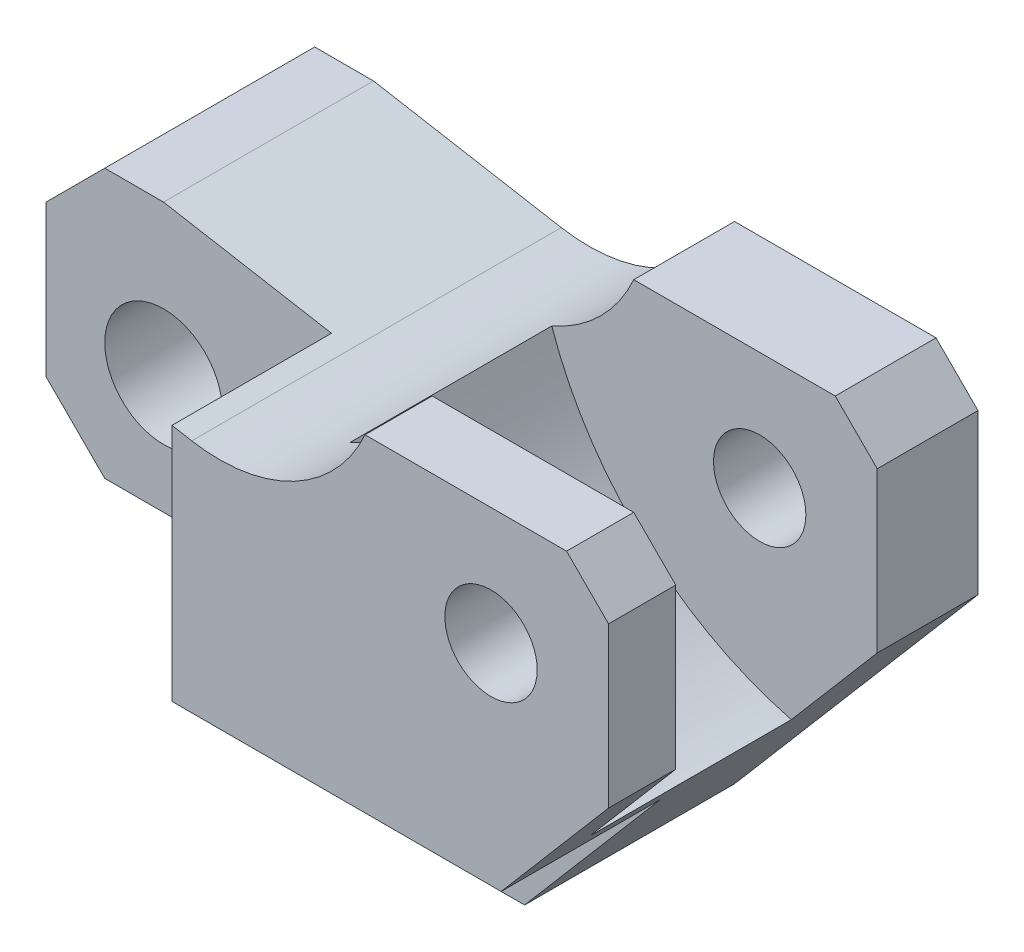
ISO-10303-21;
HEADER;
FILE_DESCRIPTION(('STEP AP214'),'2;1');
FILE_NAME('part.step','',(''),(''),'','','');
FILE_SCHEMA(('AUTOMOTIVE_DESIGN { 1 0 10303 214 1 1 1 1 }'));
ENDSEC;
DATA;
#1=APPLICATION_CONTEXT('core data for automotive mechanical design processes');
#2=APPLICATION_PROTOCOL_DEFINITION('international standard','automotive_design',2000,#1);
#3=PRODUCT_CONTEXT('',#1,'mechanical');
#4=PRODUCT('Part','Part','',(#3));
#5=PRODUCT_RELATED_PRODUCT_CATEGORY('part','',(#4));
#6=PRODUCT_DEFINITION_FORMATION('','',#4);
#7=PRODUCT_DEFINITION_CONTEXT('part definition',#1,'design');
#8=PRODUCT_DEFINITION('design','',#6,#7);
#9=PRODUCT_DEFINITION_SHAPE('','',#8);
#10=(LENGTH_UNIT() NAMED_UNIT(*) SI_UNIT(.MILLI.,.METRE.));
#11=(NAMED_UNIT(*) PLANE_ANGLE_UNIT() SI_UNIT($,.RADIAN.));
#12=(NAMED_UNIT(*) SI_UNIT($,.STERADIAN.) SOLID_ANGLE_UNIT());
#13=UNCERTAINTY_MEASURE_WITH_UNIT(LENGTH_MEASURE(1.E-05),#10,'distance_accuracy_value','');
#14=(GEOMETRIC_REPRESENTATION_CONTEXT(3) GLOBAL_UNCERTAINTY_ASSIGNED_CONTEXT((#13)) GLOBAL_UNIT_ASSIGNED_CONTEXT((#10,
#11,#12)) REPRESENTATION_CONTEXT('',''));
#15=CARTESIAN_POINT('',(0.,0.,0.));
#16=DIRECTION('',(0.,0.,1.));
#17=DIRECTION('',(1.,0.,0.));
#18=AXIS2_PLACEMENT_3D('',#15,#16,#17);
#19=CARTESIAN_POINT('',(72.,1.,44.));
#20=DIRECTION('',(-0.760833951959086,0.64894660608275,0.));
#21=DIRECTION('',(-0.64894660608275,-0.760833951959086,0.));
#22=AXIS2_PLACEMENT_3D('',#19,#20,#21);
#23=PLANE('',#22);
#24=DIRECTION('',(-0.64894660608275,-0.760833951959086,0.));
#25=VECTOR('',#24,1.);
#26=CARTESIAN_POINT('',(61.7647058823529,-11.,36.));
#27=LINE('',#26,#25);
#28=CARTESIAN_POINT('',(72.,1.,36.));
#29=VERTEX_POINT('',#28);
#30=CARTESIAN_POINT('',(61.7647058823529,-11.,36.));
#31=VERTEX_POINT('',#30);
#32=EDGE_CURVE('E423',#29,#31,#27,.T.);
#33=ORIENTED_EDGE('',*,*,#32,.F.);
#34=DIRECTION('',(0.,0.,-1.));
#35=VECTOR('',#34,1.);
#36=CARTESIAN_POINT('',(72.,1.,44.));
#37=LINE('',#36,#35);
#38=CARTESIAN_POINT('',(72.,1.,44.));
#39=VERTEX_POINT('',#38);
#40=EDGE_CURVE('E242',#39,#29,#37,.T.);
#41=ORIENTED_EDGE('',*,*,#40,.F.);
#42=DIRECTION('',(0.64894660608275,0.760833951959086,0.));
#43=VECTOR('',#42,1.);
#44=CARTESIAN_POINT('',(72.,1.,44.));
#45=LINE('',#44,#43);
#46=CARTESIAN_POINT('',(59.2058823529412,-14.,44.));
#47=VERTEX_POINT('',#46);
#48=EDGE_CURVE('E318',#47,#39,#45,.T.);
#49=ORIENTED_EDGE('',*,*,#48,.F.);
#50=DIRECTION('',(0.,0.,-1.));
#51=VECTOR('',#50,1.);
#52=CARTESIAN_POINT('',(59.2058823529412,-14.,184.845660210033));
#53=LINE('',#52,#51);
#54=CARTESIAN_POINT('',(59.2058823529412,-14.,25.));
#55=VERTEX_POINT('',#54);
#56=EDGE_CURVE('E302',#47,#55,#53,.T.);
#57=ORIENTED_EDGE('',*,*,#56,.T.);
#58=DIRECTION('',(0.64894660608275,0.760833951959086,0.));
#59=VECTOR('',#58,1.);
#60=CARTESIAN_POINT('',(72.,1.,25.));
#61=LINE('',#60,#59);
#62=CARTESIAN_POINT('',(43.,-33.,25.));
#63=VERTEX_POINT('',#62);
#64=EDGE_CURVE('E303',#63,#55,#61,.T.);
#65=ORIENTED_EDGE('',*,*,#64,.F.);
#66=DIRECTION('',(0.,0.,-1.));
#67=VECTOR('',#66,1.);
#68=CARTESIAN_POINT('',(43.,-33.,44.));
#69=LINE('',#68,#67);
#70=CARTESIAN_POINT('',(43.,-33.,0.));
#71=VERTEX_POINT('',#70);
#72=EDGE_CURVE('E245',#63,#71,#69,.T.);
#73=ORIENTED_EDGE('',*,*,#72,.T.);
#74=DIRECTION('',(0.64894660608275,0.760833951959086,0.));
#75=VECTOR('',#74,1.);
#76=CARTESIAN_POINT('',(72.,1.,0.));
#77=LINE('',#76,#75);
#78=CARTESIAN_POINT('',(72.,1.,0.));
#79=VERTEX_POINT('',#78);
#80=EDGE_CURVE('E349',#71,#79,#77,.T.);
#81=ORIENTED_EDGE('',*,*,#80,.T.);
#82=CARTESIAN_POINT('',(72.,1.,12.));
#83=VERTEX_POINT('',#82);
#84=EDGE_CURVE('E241',#83,#79,#37,.T.);
#85=ORIENTED_EDGE('',*,*,#84,.F.);
#86=DIRECTION('',(-0.64894660608275,-0.760833951959086,0.));
#87=VECTOR('',#86,1.);
#88=CARTESIAN_POINT('',(61.7647058823529,-11.,12.));
#89=LINE('',#88,#87);
#90=CARTESIAN_POINT('',(61.7647058823529,-11.,12.));
#91=VERTEX_POINT('',#90);
#92=EDGE_CURVE('E436',#83,#91,#89,.T.);
#93=ORIENTED_EDGE('',*,*,#92,.T.);
#94=DIRECTION('',(0.,0.,-1.));
#95=VECTOR('',#94,1.);
#96=CARTESIAN_POINT('',(61.7647058823529,-11.,36.));
#97=LINE('',#96,#95);
#98=EDGE_CURVE('E267',#31,#91,#97,.T.);
#99=ORIENTED_EDGE('',*,*,#98,.F.);
#100=EDGE_LOOP('',(#33,#41,#49,#57,#65,#73,#81,#85,#93,#99));
#101=FACE_BOUND('',#100,.T.);
#102=ADVANCED_FACE('F45',(#101),#23,.F.);
#103=CARTESIAN_POINT('',(72.,20.,44.));
#104=DIRECTION('',(-1.,0.,0.));
#105=DIRECTION('',(0.,0.,1.));
#106=AXIS2_PLACEMENT_3D('',#103,#104,#105);
#107=PLANE('',#106);
#108=DIRECTION('',(0.,-1.,0.));
#109=VECTOR('',#108,1.);
#110=CARTESIAN_POINT('',(72.,1.,36.));
#111=LINE('',#110,#109);
#112=CARTESIAN_POINT('',(72.,20.,36.));
#113=VERTEX_POINT('',#112);
#114=EDGE_CURVE('E421',#113,#29,#111,.T.);
#115=ORIENTED_EDGE('',*,*,#114,.F.);
#116=DIRECTION('',(0.,0.,-1.));
#117=VECTOR('',#116,1.);
#118=CARTESIAN_POINT('',(72.,20.,44.));
#119=LINE('',#118,#117);
#120=CARTESIAN_POINT('',(72.,20.,44.));
#121=VERTEX_POINT('',#120);
#122=EDGE_CURVE('E238',#121,#113,#119,.T.);
#123=ORIENTED_EDGE('',*,*,#122,.F.);
#124=DIRECTION('',(0.,1.,0.));
#125=VECTOR('',#124,1.);
#126=CARTESIAN_POINT('',(72.,20.,44.));
#127=LINE('',#126,#125);
#128=EDGE_CURVE('E321',#39,#121,#127,.T.);
#129=ORIENTED_EDGE('',*,*,#128,.F.);
#130=ORIENTED_EDGE('',*,*,#40,.T.);
#131=EDGE_LOOP('',(#115,#123,#129,#130));
#132=FACE_BOUND('',#131,.T.);
#133=ADVANCED_FACE('F480',(#132),#107,.F.);
#134=CARTESIAN_POINT('',(66.9999999999999,25.,44.));
#135=DIRECTION('',(-0.707106781186543,-0.707106781186552,0.));
#136=DIRECTION('',(0.707106781186552,-0.707106781186543,0.));
#137=AXIS2_PLACEMENT_3D('',#134,#135,#136);
#138=PLANE('',#137);
#139=DIRECTION('',(0.707106781186552,-0.707106781186543,0.));
#140=VECTOR('',#139,1.);
#141=CARTESIAN_POINT('',(72.,20.,36.));
#142=LINE('',#141,#140);
#143=CARTESIAN_POINT('',(66.9999999999999,25.,36.));
#144=VERTEX_POINT('',#143);
#145=EDGE_CURVE('E224',#144,#113,#142,.T.);
#146=ORIENTED_EDGE('',*,*,#145,.F.);
#147=DIRECTION('',(0.,0.,-1.));
#148=VECTOR('',#147,1.);
#149=CARTESIAN_POINT('',(66.9999999999999,25.,44.));
#150=LINE('',#149,#148);
#151=CARTESIAN_POINT('',(66.9999999999999,25.,44.));
#152=VERTEX_POINT('',#151);
#153=EDGE_CURVE('E223',#152,#144,#150,.T.);
#154=ORIENTED_EDGE('',*,*,#153,.F.);
#155=DIRECTION('',(-0.707106781186552,0.707106781186543,0.));
#156=VECTOR('',#155,1.);
#157=CARTESIAN_POINT('',(66.9999999999999,25.,44.));
#158=LINE('',#157,#156);
#159=EDGE_CURVE('E323',#121,#152,#158,.T.);
#160=ORIENTED_EDGE('',*,*,#159,.F.);
#161=ORIENTED_EDGE('',*,*,#122,.T.);
#162=EDGE_LOOP('',(#146,#154,#160,#161));
#163=FACE_BOUND('',#162,.T.);
#164=ADVANCED_FACE('F419',(#163),#138,.F.);
#165=CARTESIAN_POINT('',(43.,25.,44.));
#166=DIRECTION('',(0.,-1.,0.));
#167=DIRECTION('',(0.,0.,-1.));
#168=AXIS2_PLACEMENT_3D('',#165,#166,#167);
#169=PLANE('',#168);
#170=DIRECTION('',(1.,0.,0.));
#171=VECTOR('',#170,1.);
#172=CARTESIAN_POINT('',(66.9999999999999,25.,36.));
#173=LINE('',#172,#171);
#174=CARTESIAN_POINT('',(43.,25.,36.));
#175=VERTEX_POINT('',#174);
#176=EDGE_CURVE('E206',#175,#144,#173,.T.);
#177=ORIENTED_EDGE('',*,*,#176,.F.);
#178=DIRECTION('',(0.,0.,-1.));
#179=VECTOR('',#178,1.);
#180=CARTESIAN_POINT('',(43.,25.,44.));
#181=LINE('',#180,#179);
#182=CARTESIAN_POINT('',(43.,25.,44.));
#183=VERTEX_POINT('',#182);
#184=EDGE_CURVE('E220',#183,#175,#181,.T.);
#185=ORIENTED_EDGE('',*,*,#184,.F.);
#186=DIRECTION('',(-1.,0.,0.));
#187=VECTOR('',#186,1.);
#188=CARTESIAN_POINT('',(43.,25.,44.));
#189=LINE('',#188,#187);
#190=EDGE_CURVE('E325',#152,#183,#189,.T.);
#191=ORIENTED_EDGE('',*,*,#190,.F.);
#192=ORIENTED_EDGE('',*,*,#153,.T.);
#193=EDGE_LOOP('',(#177,#185,#191,#192));
#194=FACE_BOUND('',#193,.T.);
#195=ADVANCED_FACE('F218',(#194),#169,.F.);
#196=CARTESIAN_POINT('',(25.6606962114488,32.7684325399872,44.));
#197=DIRECTION('',(0.,0.,-1.));
#198=DIRECTION('',(-1.,0.,0.));
#199=AXIS2_PLACEMENT_3D('',#196,#197,#198);
#200=CYLINDRICAL_SURFACE('',#199,19.);
#201=CARTESIAN_POINT('',(25.6606962114488,32.7684325399872,36.));
#202=DIRECTION('',(0.,0.,1.));
#203=DIRECTION('',(-1.,0.,0.));
#204=AXIS2_PLACEMENT_3D('',#201,#202,#203);
#205=CIRCLE('',#204,19.);
#206=CARTESIAN_POINT('',(33.2369365490243,15.344294617344,36.));
#207=VERTEX_POINT('',#206);
#208=EDGE_CURVE('E202',#207,#175,#205,.T.);
#209=ORIENTED_EDGE('',*,*,#208,.F.);
#210=DIRECTION('',(0.,0.,-1.));
#211=VECTOR('',#210,1.);
#212=CARTESIAN_POINT('',(33.2369365490243,15.344294617344,36.));
#213=LINE('',#212,#211);
#214=CARTESIAN_POINT('',(33.2369365490243,15.344294617344,12.));
#215=VERTEX_POINT('',#214);
#216=EDGE_CURVE('E262',#207,#215,#213,.T.);
#217=ORIENTED_EDGE('',*,*,#216,.T.);
#218=CARTESIAN_POINT('',(25.6606962114488,32.7684325399872,12.));
#219=DIRECTION('',(0.,0.,1.));
#220=DIRECTION('',(-1.,0.,0.));
#221=AXIS2_PLACEMENT_3D('',#218,#219,#220);
#222=CIRCLE('',#221,19.);
#223=CARTESIAN_POINT('',(43.,25.,12.));
#224=VERTEX_POINT('',#223);
#225=EDGE_CURVE('E428',#215,#224,#222,.T.);
#226=ORIENTED_EDGE('',*,*,#225,.T.);
#227=CARTESIAN_POINT('',(43.,25.,0.));
#228=VERTEX_POINT('',#227);
#229=EDGE_CURVE('E230',#224,#228,#181,.T.);
#230=ORIENTED_EDGE('',*,*,#229,.T.);
#231=CARTESIAN_POINT('',(25.6606962114488,32.7684325399872,0.));
#232=DIRECTION('',(0.,0.,-1.));
#233=DIRECTION('',(1.,0.,0.));
#234=AXIS2_PLACEMENT_3D('',#231,#232,#233);
#235=CIRCLE('',#234,19.);
#236=CARTESIAN_POINT('',(22.3613808357771,14.0570852327553,0.));
#237=VERTEX_POINT('',#236);
#238=EDGE_CURVE('E361',#228,#237,#235,.T.);
#239=ORIENTED_EDGE('',*,*,#238,.T.);
#240=DIRECTION('',(0.,0.,-1.));
#241=VECTOR('',#240,1.);
#242=CARTESIAN_POINT('',(22.3613808357771,14.0570852327553,44.));
#243=LINE('',#242,#241);
#244=CARTESIAN_POINT('',(22.3613808357771,14.0570852327553,44.));
#245=VERTEX_POINT('',#244);
#246=EDGE_CURVE('E233',#245,#237,#243,.T.);
#247=ORIENTED_EDGE('',*,*,#246,.F.);
#248=CARTESIAN_POINT('',(25.6606962114488,32.7684325399872,44.));
#249=DIRECTION('',(0.,0.,-1.));
#250=DIRECTION('',(1.,0.,0.));
#251=AXIS2_PLACEMENT_3D('',#248,#249,#250);
#252=CIRCLE('',#251,19.);
#253=EDGE_CURVE('E228',#183,#245,#252,.T.);
#254=ORIENTED_EDGE('',*,*,#253,.F.);
#255=ORIENTED_EDGE('',*,*,#184,.T.);
#256=EDGE_LOOP('',(#209,#217,#226,#230,#239,#247,#254,#255));
#257=FACE_BOUND('',#256,.T.);
#258=ADVANCED_FACE('F226',(#257),#200,.F.);
#259=CARTESIAN_POINT('',(58.,11.,0.));
#260=DIRECTION('',(0.,0.,1.));
#261=DIRECTION('',(1.,0.,0.));
#262=AXIS2_PLACEMENT_3D('',#259,#260,#261);
#263=CYLINDRICAL_SURFACE('',#262,5.5);
#264=CARTESIAN_POINT('',(58.,11.,44.));
#265=DIRECTION('',(0.,0.,1.));
#266=DIRECTION('',(1.,0.,0.));
#267=AXIS2_PLACEMENT_3D('',#264,#265,#266);
#268=CIRCLE('',#267,5.5);
#269=CARTESIAN_POINT('',(63.5,11.,44.));
#270=VERTEX_POINT('',#269);
#271=EDGE_CURVE('E266',#270,#270,#268,.T.);
#272=ORIENTED_EDGE('',*,*,#271,.T.);
#273=EDGE_LOOP('',(#272));
#274=FACE_BOUND('',#273,.T.);
#275=CARTESIAN_POINT('',(58.,11.,36.));
#276=DIRECTION('',(0.,0.,-1.));
#277=DIRECTION('',(-1.,0.,0.));
#278=AXIS2_PLACEMENT_3D('',#275,#276,#277);
#279=CIRCLE('',#278,5.5);
#280=CARTESIAN_POINT('',(52.5,11.,36.));
#281=VERTEX_POINT('',#280);
#282=EDGE_CURVE('E49',#281,#281,#279,.F.);
#283=ORIENTED_EDGE('',*,*,#282,.F.);
#284=EDGE_LOOP('',(#283));
#285=FACE_BOUND('',#284,.T.);
#286=ADVANCED_FACE('F515',(#274,#285),#263,.F.);
#287=CARTESIAN_POINT('',(25.5755389113407,-19.,44.));
#288=DIRECTION('',(0.,0.,-1.));
#289=DIRECTION('',(-1.,0.,0.));
#290=AXIS2_PLACEMENT_3D('',#287,#288,#289);
#291=PLANE('',#290);
#292=ORIENTED_EDGE('',*,*,#271,.F.);
#293=EDGE_LOOP('',(#292));
#294=FACE_BOUND('',#293,.T.);
#295=DIRECTION('',(-0.984807753012208,0.173648177666931,0.));
#296=VECTOR('',#295,1.);
#297=CARTESIAN_POINT('',(0.,18.,44.));
#298=LINE('',#297,#296);
#299=CARTESIAN_POINT('',(20.,14.4734603858307,44.));
#300=VERTEX_POINT('',#299);
#301=EDGE_CURVE('E328',#245,#300,#298,.T.);
#302=ORIENTED_EDGE('',*,*,#301,.T.);
#303=DIRECTION('',(0.,1.,0.));
#304=VECTOR('',#303,1.);
#305=CARTESIAN_POINT('',(20.,-33.,44.));
#306=LINE('',#305,#304);
#307=CARTESIAN_POINT('',(20.,-14.,44.));
#308=VERTEX_POINT('',#307);
#309=EDGE_CURVE('E279',#308,#300,#306,.T.);
#310=ORIENTED_EDGE('',*,*,#309,.F.);
#311=DIRECTION('',(1.,0.,0.));
#312=VECTOR('',#311,1.);
#313=CARTESIAN_POINT('',(-6.99999999999997,-14.,44.));
#314=LINE('',#313,#312);
#315=EDGE_CURVE('E316',#308,#47,#314,.T.);
#316=ORIENTED_EDGE('',*,*,#315,.T.);
#317=ORIENTED_EDGE('',*,*,#48,.T.);
#318=ORIENTED_EDGE('',*,*,#128,.T.);
#319=ORIENTED_EDGE('',*,*,#159,.T.);
#320=ORIENTED_EDGE('',*,*,#190,.T.);
#321=ORIENTED_EDGE('',*,*,#253,.T.);
#322=EDGE_LOOP('',(#302,#310,#316,#317,#318,#319,#320,#321));
#323=FACE_BOUND('',#322,.T.);
#324=ADVANCED_FACE('F414',(#294,#323),#291,.F.);
#325=CARTESIAN_POINT('',(25.5755389113407,-19.,0.));
#326=DIRECTION('',(0.,0.,-1.));
#327=DIRECTION('',(-1.,0.,0.));
#328=AXIS2_PLACEMENT_3D('',#325,#326,#327);
#329=PLANE('',#328);
#330=CARTESIAN_POINT('',(58.,11.,0.));
#331=DIRECTION('',(0.,0.,1.));
#332=DIRECTION('',(1.,0.,0.));
#333=AXIS2_PLACEMENT_3D('',#330,#331,#332);
#334=CIRCLE('',#333,5.5);
#335=CARTESIAN_POINT('',(63.5,11.,0.));
#336=VERTEX_POINT('',#335);
#337=EDGE_CURVE('E273',#336,#336,#334,.T.);
#338=ORIENTED_EDGE('',*,*,#337,.T.);
#339=EDGE_LOOP('',(#338));
#340=FACE_BOUND('',#339,.T.);
#341=DIRECTION('',(0.,-1.,0.));
#342=VECTOR('',#341,1.);
#343=CARTESIAN_POINT('',(-14.,11.,0.));
#344=LINE('',#343,#342);
#345=CARTESIAN_POINT('',(-14.,11.,0.));
#346=VERTEX_POINT('',#345);
#347=CARTESIAN_POINT('',(-14.,-7.,0.));
#348=VERTEX_POINT('',#347);
#349=EDGE_CURVE('E315',#346,#348,#344,.T.);
#350=ORIENTED_EDGE('',*,*,#349,.F.);
#351=DIRECTION('',(-0.707106781186543,-0.707106781186552,0.));
#352=VECTOR('',#351,1.);
#353=CARTESIAN_POINT('',(-14.,11.,0.));
#354=LINE('',#353,#352);
#355=CARTESIAN_POINT('',(-7.0000000000001,18.,0.));
#356=VERTEX_POINT('',#355);
#357=EDGE_CURVE('E319',#356,#346,#354,.T.);
#358=ORIENTED_EDGE('',*,*,#357,.F.);
#359=DIRECTION('',(-1.,0.,0.));
#360=VECTOR('',#359,1.);
#361=CARTESIAN_POINT('',(-7.0000000000001,18.,0.));
#362=LINE('',#361,#360);
#363=CARTESIAN_POINT('',(0.,18.,0.));
#364=VERTEX_POINT('',#363);
#365=EDGE_CURVE('E366',#364,#356,#362,.T.);
#366=ORIENTED_EDGE('',*,*,#365,.F.);
#367=DIRECTION('',(-0.984807753012208,0.173648177666931,0.));
#368=VECTOR('',#367,1.);
#369=CARTESIAN_POINT('',(0.,18.,0.));
#370=LINE('',#369,#368);
#371=EDGE_CURVE('E363',#237,#364,#370,.T.);
#372=ORIENTED_EDGE('',*,*,#371,.F.);
#373=ORIENTED_EDGE('',*,*,#238,.F.);
#374=DIRECTION('',(-1.,0.,0.));
#375=VECTOR('',#374,1.);
#376=CARTESIAN_POINT('',(43.,25.,0.));
#377=LINE('',#376,#375);
#378=CARTESIAN_POINT('',(66.9999999999999,25.,0.));
#379=VERTEX_POINT('',#378);
#380=EDGE_CURVE('E358',#379,#228,#377,.T.);
#381=ORIENTED_EDGE('',*,*,#380,.F.);
#382=DIRECTION('',(-0.707106781186552,0.707106781186543,0.));
#383=VECTOR('',#382,1.);
#384=CARTESIAN_POINT('',(66.9999999999999,25.,0.));
#385=LINE('',#384,#383);
#386=CARTESIAN_POINT('',(72.,20.,0.));
#387=VERTEX_POINT('',#386);
#388=EDGE_CURVE('E355',#387,#379,#385,.T.);
#389=ORIENTED_EDGE('',*,*,#388,.F.);
#390=DIRECTION('',(0.,1.,0.));
#391=VECTOR('',#390,1.);
#392=CARTESIAN_POINT('',(72.,20.,0.));
#393=LINE('',#392,#391);
#394=EDGE_CURVE('E352',#79,#387,#393,.T.);
#395=ORIENTED_EDGE('',*,*,#394,.F.);
#396=ORIENTED_EDGE('',*,*,#80,.F.);
#397=DIRECTION('',(1.,0.,0.));
#398=VECTOR('',#397,1.);
#399=CARTESIAN_POINT('',(43.,-33.,0.));
#400=LINE('',#399,#398);
#401=CARTESIAN_POINT('',(37.2969800527345,-33.,0.));
#402=VERTEX_POINT('',#401);
#403=EDGE_CURVE('E346',#402,#71,#400,.T.);
#404=ORIENTED_EDGE('',*,*,#403,.F.);
#405=CARTESIAN_POINT('',(59.2058823529412,-14.,0.));
#406=DIRECTION('',(0.,0.,1.));
#407=DIRECTION('',(1.,0.,0.));
#408=AXIS2_PLACEMENT_3D('',#405,#406,#407);
#409=CIRCLE('',#408,29.);
#410=CARTESIAN_POINT('',(30.5211776527525,-18.2647058823529,0.));
#411=VERTEX_POINT('',#410);
#412=EDGE_CURVE('E343',#411,#402,#409,.T.);
#413=ORIENTED_EDGE('',*,*,#412,.F.);
#414=CARTESIAN_POINT('',(25.5755389113407,-19.,0.));
#415=DIRECTION('',(0.,0.,-1.));
#416=DIRECTION('',(-1.,0.,0.));
#417=AXIS2_PLACEMENT_3D('',#414,#415,#416);
#418=CIRCLE('',#417,5.);
#419=CARTESIAN_POINT('',(25.5755389113407,-14.,0.));
#420=VERTEX_POINT('',#419);
#421=EDGE_CURVE('E340',#420,#411,#418,.T.);
#422=ORIENTED_EDGE('',*,*,#421,.F.);
#423=DIRECTION('',(1.,0.,0.));
#424=VECTOR('',#423,1.);
#425=CARTESIAN_POINT('',(-6.99999999999997,-14.,0.));
#426=LINE('',#425,#424);
#427=CARTESIAN_POINT('',(-6.99999999999997,-14.,0.));
#428=VERTEX_POINT('',#427);
#429=EDGE_CURVE('E337',#428,#420,#426,.T.);
#430=ORIENTED_EDGE('',*,*,#429,.F.);
#431=DIRECTION('',(0.707106781186549,-0.707106781186546,0.));
#432=VECTOR('',#431,1.);
#433=CARTESIAN_POINT('',(-14.,-7.,0.));
#434=LINE('',#433,#432);
#435=EDGE_CURVE('E334',#348,#428,#434,.T.);
#436=ORIENTED_EDGE('',*,*,#435,.F.);
#437=EDGE_LOOP('',(#350,#358,#366,#372,#373,#381,#389,#395,#396,#404,#413,#422,#430,#436));
#438=FACE_BOUND('',#437,.T.);
#439=CARTESIAN_POINT('',(0.,0.,0.));
#440=DIRECTION('',(0.,0.,1.));
#441=DIRECTION('',(1.,0.,0.));
#442=AXIS2_PLACEMENT_3D('',#439,#440,#441);
#443=CIRCLE('',#442,7.);
#444=CARTESIAN_POINT('',(7.,0.,0.));
#445=VERTEX_POINT('',#444);
#446=EDGE_CURVE('E306',#445,#445,#443,.T.);
#447=ORIENTED_EDGE('',*,*,#446,.T.);
#448=EDGE_LOOP('',(#447));
#449=FACE_BOUND('',#448,.T.);
#450=ADVANCED_FACE('F385',(#340,#438,#449),#329,.T.);
#451=CARTESIAN_POINT('',(-14.,11.,44.));
#452=DIRECTION('',(1.,0.,0.));
#453=DIRECTION('',(0.,0.,-1.));
#454=AXIS2_PLACEMENT_3D('',#451,#452,#453);
#455=PLANE('',#454);
#456=DIRECTION('',(0.,0.,-1.));
#457=VECTOR('',#456,1.);
#458=CARTESIAN_POINT('',(-14.,-7.,44.));
#459=LINE('',#458,#457);
#460=CARTESIAN_POINT('',(-14.,-7.,25.));
#461=VERTEX_POINT('',#460);
#462=EDGE_CURVE('E54',#461,#348,#459,.T.);
#463=ORIENTED_EDGE('',*,*,#462,.F.);
#464=DIRECTION('',(0.,1.,0.));
#465=VECTOR('',#464,1.);
#466=CARTESIAN_POINT('',(-14.,11.,25.));
#467=LINE('',#466,#465);
#468=CARTESIAN_POINT('',(-14.,11.,25.));
#469=VERTEX_POINT('',#468);
#470=EDGE_CURVE('E284',#461,#469,#467,.T.);
#471=ORIENTED_EDGE('',*,*,#470,.T.);
#472=DIRECTION('',(0.,0.,-1.));
#473=VECTOR('',#472,1.);
#474=CARTESIAN_POINT('',(-14.,11.,44.));
#475=LINE('',#474,#473);
#476=EDGE_CURVE('E331',#469,#346,#475,.T.);
#477=ORIENTED_EDGE('',*,*,#476,.T.);
#478=ORIENTED_EDGE('',*,*,#349,.T.);
#479=EDGE_LOOP('',(#463,#471,#477,#478));
#480=FACE_BOUND('',#479,.T.);
#481=ADVANCED_FACE('F47',(#480),#455,.F.);
#482=CARTESIAN_POINT('',(-14.,-7.,44.));
#483=DIRECTION('',(0.707106781186546,0.707106781186549,0.));
#484=DIRECTION('',(-0.707106781186549,0.707106781186546,0.));
#485=AXIS2_PLACEMENT_3D('',#482,#483,#484);
#486=PLANE('',#485);
#487=DIRECTION('',(0.,0.,-1.));
#488=VECTOR('',#487,1.);
#489=CARTESIAN_POINT('',(-6.99999999999997,-14.,44.));
#490=LINE('',#489,#488);
#491=CARTESIAN_POINT('',(-6.99999999999997,-14.,25.));
#492=VERTEX_POINT('',#491);
#493=EDGE_CURVE('E253',#492,#428,#490,.T.);
#494=ORIENTED_EDGE('',*,*,#493,.F.);
#495=DIRECTION('',(-0.707106781186549,0.707106781186546,0.));
#496=VECTOR('',#495,1.);
#497=CARTESIAN_POINT('',(-14.,-7.,25.));
#498=LINE('',#497,#496);
#499=EDGE_CURVE('E287',#492,#461,#498,.T.);
#500=ORIENTED_EDGE('',*,*,#499,.T.);
#501=ORIENTED_EDGE('',*,*,#462,.T.);
#502=ORIENTED_EDGE('',*,*,#435,.T.);
#503=EDGE_LOOP('',(#494,#500,#501,#502));
#504=FACE_BOUND('',#503,.T.);
#505=ADVANCED_FACE('F400',(#504),#486,.F.);
#506=CARTESIAN_POINT('',(-6.99999999999997,-14.,44.));
#507=DIRECTION('',(0.,1.,0.));
#508=DIRECTION('',(0.,0.,1.));
#509=AXIS2_PLACEMENT_3D('',#506,#507,#508);
#510=PLANE('',#509);
#511=DIRECTION('',(0.,0.,-1.));
#512=VECTOR('',#511,1.);
#513=CARTESIAN_POINT('',(20.,-14.,44.));
#514=LINE('',#513,#512);
#515=CARTESIAN_POINT('',(20.,-14.,25.));
#516=VERTEX_POINT('',#515);
#517=EDGE_CURVE('E296',#308,#516,#514,.T.);
#518=ORIENTED_EDGE('',*,*,#517,.T.);
#519=DIRECTION('',(-1.,0.,0.));
#520=VECTOR('',#519,1.);
#521=CARTESIAN_POINT('',(-6.99999999999997,-14.,25.));
#522=LINE('',#521,#520);
#523=EDGE_CURVE('E290',#516,#492,#522,.T.);
#524=ORIENTED_EDGE('',*,*,#523,.T.);
#525=ORIENTED_EDGE('',*,*,#493,.T.);
#526=ORIENTED_EDGE('',*,*,#429,.T.);
#527=DIRECTION('',(0.,0.,-1.));
#528=VECTOR('',#527,1.);
#529=CARTESIAN_POINT('',(25.5755389113407,-14.,44.));
#530=LINE('',#529,#528);
#531=CARTESIAN_POINT('',(25.5755389113407,-14.,25.));
#532=VERTEX_POINT('',#531);
#533=EDGE_CURVE('E251',#532,#420,#530,.T.);
#534=ORIENTED_EDGE('',*,*,#533,.F.);
#535=DIRECTION('',(-1.,0.,0.));
#536=VECTOR('',#535,1.);
#537=CARTESIAN_POINT('',(25.5755389113407,-14.,25.));
#538=LINE('',#537,#536);
#539=EDGE_CURVE('E300',#55,#532,#538,.T.);
#540=ORIENTED_EDGE('',*,*,#539,.F.);
#541=ORIENTED_EDGE('',*,*,#56,.F.);
#542=ORIENTED_EDGE('',*,*,#315,.F.);
#543=EDGE_LOOP('',(#518,#524,#525,#526,#534,#540,#541,#542));
#544=FACE_BOUND('',#543,.T.);
#545=ADVANCED_FACE('F406',(#544),#510,.F.);
#546=CARTESIAN_POINT('',(25.5755389113407,-19.,44.));
#547=DIRECTION('',(0.,0.,-1.));
#548=DIRECTION('',(-1.,0.,0.));
#549=AXIS2_PLACEMENT_3D('',#546,#547,#548);
#550=CYLINDRICAL_SURFACE('',#549,5.);
#551=DIRECTION('',(0.,0.,-1.));
#552=VECTOR('',#551,1.);
#553=CARTESIAN_POINT('',(30.5211776527525,-18.2647058823529,44.));
#554=LINE('',#553,#552);
#555=CARTESIAN_POINT('',(30.5211776527525,-18.2647058823529,25.));
#556=VERTEX_POINT('',#555);
#557=EDGE_CURVE('E249',#556,#411,#554,.T.);
#558=ORIENTED_EDGE('',*,*,#557,.F.);
#559=CARTESIAN_POINT('',(25.5755389113407,-19.,25.));
#560=DIRECTION('',(0.,0.,-1.));
#561=DIRECTION('',(-1.,0.,0.));
#562=AXIS2_PLACEMENT_3D('',#559,#560,#561);
#563=CIRCLE('',#562,5.);
#564=EDGE_CURVE('E299',#532,#556,#563,.T.);
#565=ORIENTED_EDGE('',*,*,#564,.F.);
#566=ORIENTED_EDGE('',*,*,#533,.T.);
#567=ORIENTED_EDGE('',*,*,#421,.T.);
#568=EDGE_LOOP('',(#558,#565,#566,#567));
#569=FACE_BOUND('',#568,.T.);
#570=ADVANCED_FACE('F473',(#569),#550,.F.);
#571=CARTESIAN_POINT('',(59.2058823529412,-14.,44.));
#572=DIRECTION('',(0.,0.,-1.));
#573=DIRECTION('',(-1.,0.,0.));
#574=AXIS2_PLACEMENT_3D('',#571,#572,#573);
#575=CYLINDRICAL_SURFACE('',#574,29.);
#576=DIRECTION('',(0.,0.,-1.));
#577=VECTOR('',#576,1.);
#578=CARTESIAN_POINT('',(37.2969800527345,-33.,44.));
#579=LINE('',#578,#577);
#580=CARTESIAN_POINT('',(37.2969800527345,-33.,25.));
#581=VERTEX_POINT('',#580);
#582=EDGE_CURVE('E247',#581,#402,#579,.T.);
#583=ORIENTED_EDGE('',*,*,#582,.F.);
#584=CARTESIAN_POINT('',(59.2058823529412,-14.,25.));
#585=DIRECTION('',(0.,0.,1.));
#586=DIRECTION('',(1.,0.,0.));
#587=AXIS2_PLACEMENT_3D('',#584,#585,#586);
#588=CIRCLE('',#587,29.);
#589=EDGE_CURVE('E308',#556,#581,#588,.T.);
#590=ORIENTED_EDGE('',*,*,#589,.F.);
#591=ORIENTED_EDGE('',*,*,#557,.T.);
#592=ORIENTED_EDGE('',*,*,#412,.T.);
#593=EDGE_LOOP('',(#583,#590,#591,#592));
#594=FACE_BOUND('',#593,.T.);
#595=ADVANCED_FACE('F469',(#594),#575,.T.);
#596=CARTESIAN_POINT('',(43.,-33.,44.));
#597=DIRECTION('',(0.,1.,0.));
#598=DIRECTION('',(0.,0.,1.));
#599=AXIS2_PLACEMENT_3D('',#596,#597,#598);
#600=PLANE('',#599);
#601=ORIENTED_EDGE('',*,*,#72,.F.);
#602=DIRECTION('',(1.,0.,0.));
#603=VECTOR('',#602,1.);
#604=CARTESIAN_POINT('',(43.,-33.,25.));
#605=LINE('',#604,#603);
#606=EDGE_CURVE('E310',#581,#63,#605,.T.);
#607=ORIENTED_EDGE('',*,*,#606,.F.);
#608=ORIENTED_EDGE('',*,*,#582,.T.);
#609=ORIENTED_EDGE('',*,*,#403,.T.);
#610=EDGE_LOOP('',(#601,#607,#608,#609));
#611=FACE_BOUND('',#610,.T.);
#612=ADVANCED_FACE('F464',(#611),#600,.F.);
#613=CARTESIAN_POINT('',(72.,20.,12.));
#614=VERTEX_POINT('',#613);
#615=EDGE_CURVE('E237',#614,#387,#119,.T.);
#616=ORIENTED_EDGE('',*,*,#615,.F.);
#617=DIRECTION('',(0.,-1.,0.));
#618=VECTOR('',#617,1.);
#619=CARTESIAN_POINT('',(72.,1.,12.));
#620=LINE('',#619,#618);
#621=EDGE_CURVE('E434',#614,#83,#620,.T.);
#622=ORIENTED_EDGE('',*,*,#621,.T.);
#623=ORIENTED_EDGE('',*,*,#84,.T.);
#624=ORIENTED_EDGE('',*,*,#394,.T.);
#625=EDGE_LOOP('',(#616,#622,#623,#624));
#626=FACE_BOUND('',#625,.T.);
#627=ADVANCED_FACE('F458',(#626),#107,.F.);
#628=CARTESIAN_POINT('',(66.9999999999999,25.,12.));
#629=VERTEX_POINT('',#628);
#630=EDGE_CURVE('E229',#629,#379,#150,.T.);
#631=ORIENTED_EDGE('',*,*,#630,.F.);
#632=DIRECTION('',(0.707106781186552,-0.707106781186543,0.));
#633=VECTOR('',#632,1.);
#634=CARTESIAN_POINT('',(72.,20.,12.));
#635=LINE('',#634,#633);
#636=EDGE_CURVE('E431',#629,#614,#635,.T.);
#637=ORIENTED_EDGE('',*,*,#636,.T.);
#638=ORIENTED_EDGE('',*,*,#615,.T.);
#639=ORIENTED_EDGE('',*,*,#388,.T.);
#640=EDGE_LOOP('',(#631,#637,#638,#639));
#641=FACE_BOUND('',#640,.T.);
#642=ADVANCED_FACE('F455',(#641),#138,.F.);
#643=ORIENTED_EDGE('',*,*,#229,.F.);
#644=DIRECTION('',(1.,0.,0.));
#645=VECTOR('',#644,1.);
#646=CARTESIAN_POINT('',(66.9999999999999,25.,12.));
#647=LINE('',#646,#645);
#648=EDGE_CURVE('E62',#224,#629,#647,.T.);
#649=ORIENTED_EDGE('',*,*,#648,.T.);
#650=ORIENTED_EDGE('',*,*,#630,.T.);
#651=ORIENTED_EDGE('',*,*,#380,.T.);
#652=EDGE_LOOP('',(#643,#649,#650,#651));
#653=FACE_BOUND('',#652,.T.);
#654=ADVANCED_FACE('F449',(#653),#169,.F.);
#655=CARTESIAN_POINT('',(0.,18.,44.));
#656=DIRECTION('',(-0.173648177666931,-0.984807753012208,0.));
#657=DIRECTION('',(0.984807753012208,-0.173648177666931,0.));
#658=AXIS2_PLACEMENT_3D('',#655,#656,#657);
#659=PLANE('',#658);
#660=DIRECTION('',(0.,0.,-1.));
#661=VECTOR('',#660,1.);
#662=CARTESIAN_POINT('',(0.,18.,44.));
#663=LINE('',#662,#661);
#664=CARTESIAN_POINT('',(0.,18.,25.));
#665=VERTEX_POINT('',#664);
#666=EDGE_CURVE('E373',#665,#364,#663,.T.);
#667=ORIENTED_EDGE('',*,*,#666,.F.);
#668=DIRECTION('',(0.984807753012208,-0.173648177666931,0.));
#669=VECTOR('',#668,1.);
#670=CARTESIAN_POINT('',(0.,18.,25.));
#671=LINE('',#670,#669);
#672=CARTESIAN_POINT('',(20.,14.4734603858307,25.));
#673=VERTEX_POINT('',#672);
#674=EDGE_CURVE('E293',#665,#673,#671,.T.);
#675=ORIENTED_EDGE('',*,*,#674,.T.);
#676=DIRECTION('',(0.,0.,1.));
#677=VECTOR('',#676,1.);
#678=CARTESIAN_POINT('',(20.,14.4734603858307,44.));
#679=LINE('',#678,#677);
#680=EDGE_CURVE('E11',#673,#300,#679,.T.);
#681=ORIENTED_EDGE('',*,*,#680,.T.);
#682=ORIENTED_EDGE('',*,*,#301,.F.);
#683=ORIENTED_EDGE('',*,*,#246,.T.);
#684=ORIENTED_EDGE('',*,*,#371,.T.);
#685=EDGE_LOOP('',(#667,#675,#681,#682,#683,#684));
#686=FACE_BOUND('',#685,.T.);
#687=ADVANCED_FACE('F380',(#686),#659,.F.);
#688=CARTESIAN_POINT('',(-7.0000000000001,18.,44.));
#689=DIRECTION('',(0.,-1.,0.));
#690=DIRECTION('',(0.,0.,-1.));
#691=AXIS2_PLACEMENT_3D('',#688,#689,#690);
#692=PLANE('',#691);
#693=DIRECTION('',(0.,0.,-1.));
#694=VECTOR('',#693,1.);
#695=CARTESIAN_POINT('',(-7.0000000000001,18.,44.));
#696=LINE('',#695,#694);
#697=CARTESIAN_POINT('',(-7.0000000000001,18.,25.));
#698=VERTEX_POINT('',#697);
#699=EDGE_CURVE('E372',#698,#356,#696,.T.);
#700=ORIENTED_EDGE('',*,*,#699,.F.);
#701=DIRECTION('',(-1.,0.,0.));
#702=VECTOR('',#701,1.);
#703=CARTESIAN_POINT('',(20.,18.,25.));
#704=LINE('',#703,#702);
#705=EDGE_CURVE('E70',#665,#698,#704,.T.);
#706=ORIENTED_EDGE('',*,*,#705,.F.);
#707=ORIENTED_EDGE('',*,*,#666,.T.);
#708=ORIENTED_EDGE('',*,*,#365,.T.);
#709=EDGE_LOOP('',(#700,#706,#707,#708));
#710=FACE_BOUND('',#709,.T.);
#711=ADVANCED_FACE('F390',(#710),#692,.F.);
#712=CARTESIAN_POINT('',(-14.,11.,44.));
#713=DIRECTION('',(0.707106781186552,-0.707106781186543,0.));
#714=DIRECTION('',(0.707106781186543,0.707106781186552,0.));
#715=AXIS2_PLACEMENT_3D('',#712,#713,#714);
#716=PLANE('',#715);
#717=ORIENTED_EDGE('',*,*,#476,.F.);
#718=DIRECTION('',(0.707106781186543,0.707106781186552,0.));
#719=VECTOR('',#718,1.);
#720=CARTESIAN_POINT('',(-14.,11.,25.));
#721=LINE('',#720,#719);
#722=EDGE_CURVE('E258',#469,#698,#721,.T.);
#723=ORIENTED_EDGE('',*,*,#722,.T.);
#724=ORIENTED_EDGE('',*,*,#699,.T.);
#725=ORIENTED_EDGE('',*,*,#357,.T.);
#726=EDGE_LOOP('',(#717,#723,#724,#725));
#727=FACE_BOUND('',#726,.T.);
#728=ADVANCED_FACE('F393',(#727),#716,.F.);
#729=CARTESIAN_POINT('',(0.,0.,44.));
#730=DIRECTION('',(0.,0.,-1.));
#731=DIRECTION('',(-1.,0.,0.));
#732=AXIS2_PLACEMENT_3D('',#729,#730,#731);
#733=CYLINDRICAL_SURFACE('',#732,7.);
#734=CARTESIAN_POINT('',(0.,0.,25.));
#735=DIRECTION('',(0.,0.,-1.));
#736=DIRECTION('',(-1.,0.,0.));
#737=AXIS2_PLACEMENT_3D('',#734,#735,#736);
#738=CIRCLE('',#737,7.);
#739=CARTESIAN_POINT('',(-7.,0.,25.));
#740=VERTEX_POINT('',#739);
#741=EDGE_CURVE('E256',#740,#740,#738,.T.);
#742=ORIENTED_EDGE('',*,*,#741,.F.);
#743=EDGE_LOOP('',(#742));
#744=FACE_BOUND('',#743,.T.);
#745=ORIENTED_EDGE('',*,*,#446,.F.);
#746=EDGE_LOOP('',(#745));
#747=FACE_BOUND('',#746,.T.);
#748=ADVANCED_FACE('F522',(#744,#747),#733,.F.);
#749=CARTESIAN_POINT('',(25.5755389113407,-19.,25.));
#750=DIRECTION('',(0.,0.,-1.));
#751=DIRECTION('',(-1.,0.,0.));
#752=AXIS2_PLACEMENT_3D('',#749,#750,#751);
#753=PLANE('',#752);
#754=ORIENTED_EDGE('',*,*,#539,.T.);
#755=ORIENTED_EDGE('',*,*,#564,.T.);
#756=ORIENTED_EDGE('',*,*,#589,.T.);
#757=ORIENTED_EDGE('',*,*,#606,.T.);
#758=ORIENTED_EDGE('',*,*,#64,.T.);
#759=EDGE_LOOP('',(#754,#755,#756,#757,#758));
#760=FACE_BOUND('',#759,.T.);
#761=ADVANCED_FACE('F475',(#760),#753,.F.);
#762=CARTESIAN_POINT('',(20.,-33.,44.));
#763=DIRECTION('',(1.,0.,0.));
#764=DIRECTION('',(0.,0.,-1.));
#765=AXIS2_PLACEMENT_3D('',#762,#763,#764);
#766=PLANE('',#765);
#767=ORIENTED_EDGE('',*,*,#309,.T.);
#768=ORIENTED_EDGE('',*,*,#680,.F.);
#769=DIRECTION('',(0.,1.,0.));
#770=VECTOR('',#769,1.);
#771=CARTESIAN_POINT('',(20.,-33.,25.));
#772=LINE('',#771,#770);
#773=EDGE_CURVE('E259',#516,#673,#772,.T.);
#774=ORIENTED_EDGE('',*,*,#773,.F.);
#775=ORIENTED_EDGE('',*,*,#517,.F.);
#776=EDGE_LOOP('',(#767,#768,#774,#775));
#777=FACE_BOUND('',#776,.T.);
#778=ADVANCED_FACE('F411',(#777),#766,.F.);
#779=CARTESIAN_POINT('',(20.,-33.,25.));
#780=DIRECTION('',(0.,0.,-1.));
#781=DIRECTION('',(-1.,0.,0.));
#782=AXIS2_PLACEMENT_3D('',#779,#780,#781);
#783=PLANE('',#782);
#784=ORIENTED_EDGE('',*,*,#741,.T.);
#785=EDGE_LOOP('',(#784));
#786=FACE_BOUND('',#785,.T.);
#787=ORIENTED_EDGE('',*,*,#705,.T.);
#788=ORIENTED_EDGE('',*,*,#722,.F.);
#789=ORIENTED_EDGE('',*,*,#470,.F.);
#790=ORIENTED_EDGE('',*,*,#499,.F.);
#791=ORIENTED_EDGE('',*,*,#523,.F.);
#792=ORIENTED_EDGE('',*,*,#773,.T.);
#793=ORIENTED_EDGE('',*,*,#674,.F.);
#794=EDGE_LOOP('',(#787,#788,#789,#790,#791,#792,#793));
#795=FACE_BOUND('',#794,.T.);
#796=ADVANCED_FACE('F394',(#786,#795),#783,.F.);
#797=CARTESIAN_POINT('',(58.,11.,12.));
#798=DIRECTION('',(0.,0.,-1.));
#799=DIRECTION('',(-1.,0.,0.));
#800=AXIS2_PLACEMENT_3D('',#797,#798,#799);
#801=CIRCLE('',#800,5.5);
#802=CARTESIAN_POINT('',(52.5,11.,12.));
#803=VERTEX_POINT('',#802);
#804=EDGE_CURVE('E260',#803,#803,#801,.F.);
#805=ORIENTED_EDGE('',*,*,#804,.T.);
#806=EDGE_LOOP('',(#805));
#807=FACE_BOUND('',#806,.T.);
#808=ORIENTED_EDGE('',*,*,#337,.F.);
#809=EDGE_LOOP('',(#808));
#810=FACE_BOUND('',#809,.T.);
#811=ADVANCED_FACE('F548',(#807,#810),#263,.F.);
#812=CARTESIAN_POINT('',(25.6606962114488,32.7684325399872,36.));
#813=DIRECTION('',(0.,0.,-1.));
#814=DIRECTION('',(-1.,0.,0.));
#815=AXIS2_PLACEMENT_3D('',#812,#813,#814);
#816=PLANE('',#815);
#817=ORIENTED_EDGE('',*,*,#208,.T.);
#818=ORIENTED_EDGE('',*,*,#176,.T.);
#819=ORIENTED_EDGE('',*,*,#145,.T.);
#820=ORIENTED_EDGE('',*,*,#114,.T.);
#821=ORIENTED_EDGE('',*,*,#32,.T.);
#822=CARTESIAN_POINT('',(72.,28.7018734359634,36.));
#823=DIRECTION('',(0.,0.,-1.));
#824=DIRECTION('',(1.,0.,0.));
#825=AXIS2_PLACEMENT_3D('',#822,#823,#824);
#826=CIRCLE('',#825,41.);
#827=EDGE_CURVE('E209',#31,#207,#826,.T.);
#828=ORIENTED_EDGE('',*,*,#827,.T.);
#829=EDGE_LOOP('',(#817,#818,#819,#820,#821,#828));
#830=FACE_BOUND('',#829,.T.);
#831=ORIENTED_EDGE('',*,*,#282,.T.);
#832=EDGE_LOOP('',(#831));
#833=FACE_BOUND('',#832,.T.);
#834=ADVANCED_FACE('F204',(#830,#833),#816,.T.);
#835=CARTESIAN_POINT('',(25.6606962114488,32.7684325399872,12.));
#836=DIRECTION('',(0.,0.,-1.));
#837=DIRECTION('',(-1.,0.,0.));
#838=AXIS2_PLACEMENT_3D('',#835,#836,#837);
#839=PLANE('',#838);
#840=ORIENTED_EDGE('',*,*,#225,.F.);
#841=CARTESIAN_POINT('',(72.,28.7018734359634,12.));
#842=DIRECTION('',(0.,0.,-1.));
#843=DIRECTION('',(1.,0.,0.));
#844=AXIS2_PLACEMENT_3D('',#841,#842,#843);
#845=CIRCLE('',#844,41.);
#846=EDGE_CURVE('E213',#91,#215,#845,.T.);
#847=ORIENTED_EDGE('',*,*,#846,.F.);
#848=ORIENTED_EDGE('',*,*,#92,.F.);
#849=ORIENTED_EDGE('',*,*,#621,.F.);
#850=ORIENTED_EDGE('',*,*,#636,.F.);
#851=ORIENTED_EDGE('',*,*,#648,.F.);
#852=EDGE_LOOP('',(#840,#847,#848,#849,#850,#851));
#853=FACE_BOUND('',#852,.T.);
#854=ORIENTED_EDGE('',*,*,#804,.F.);
#855=EDGE_LOOP('',(#854));
#856=FACE_BOUND('',#855,.T.);
#857=ADVANCED_FACE('F445',(#853,#856),#839,.F.);
#858=CARTESIAN_POINT('',(72.,28.7018734359634,36.));
#859=DIRECTION('',(0.,0.,-1.));
#860=DIRECTION('',(-1.,0.,0.));
#861=AXIS2_PLACEMENT_3D('',#858,#859,#860);
#862=CYLINDRICAL_SURFACE('',#861,41.);
#863=ORIENTED_EDGE('',*,*,#846,.T.);
#864=ORIENTED_EDGE('',*,*,#216,.F.);
#865=ORIENTED_EDGE('',*,*,#827,.F.);
#866=ORIENTED_EDGE('',*,*,#98,.T.);
#867=EDGE_LOOP('',(#863,#864,#865,#866));
#868=FACE_BOUND('',#867,.T.);
#869=ADVANCED_FACE('F444',(#868),#862,.F.);
#870=CLOSED_SHELL('',(#102,#133,#164,#195,#258,#286,#324,#450,#481,#505,#545,#570,#595,#612,
#627,#642,#654,#687,#711,#728,#748,#761,#778,#796,#811,#834,#857,#869));
#871=MANIFOLD_SOLID_BREP('B2',#870);
#872=ADVANCED_BREP_SHAPE_REPRESENTATION('',(#18,#871),#14);
#873=SHAPE_DEFINITION_REPRESENTATION(#9,#872);
ENDSEC;
END-ISO-10303-21;
